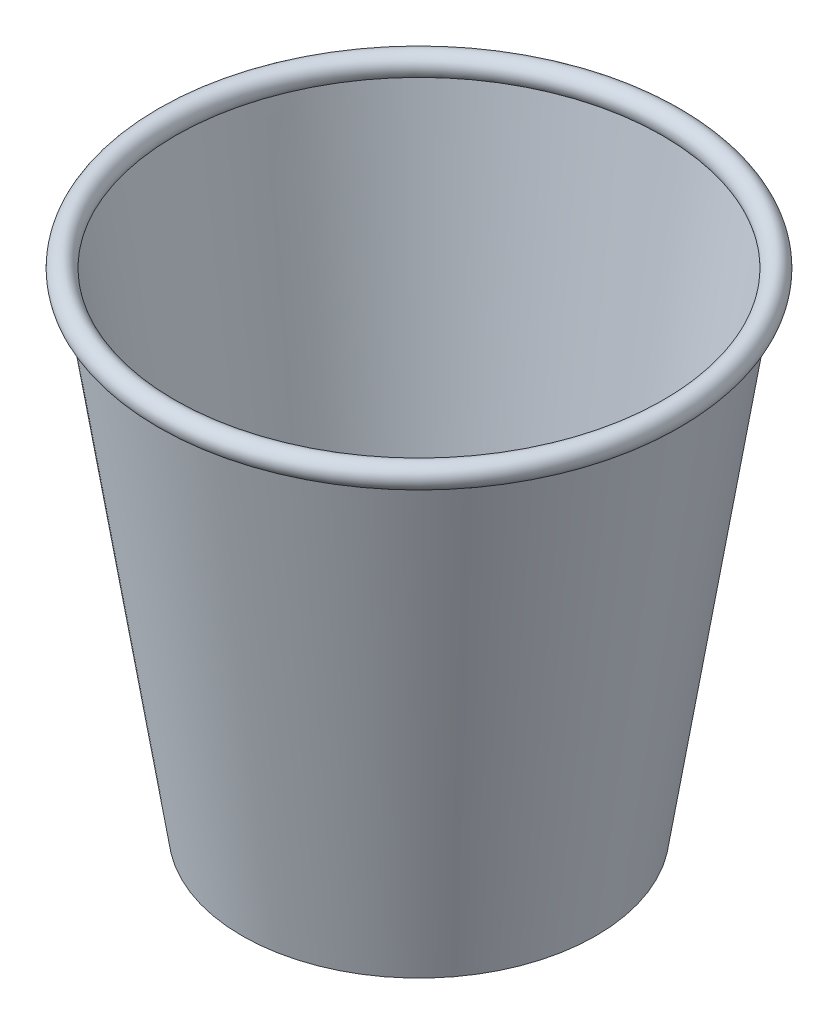
ISO-10303-21;
HEADER;
FILE_DESCRIPTION(('STEP AP214'),'2;1');
FILE_NAME('part.step','',(''),(''),'','','');
FILE_SCHEMA(('AUTOMOTIVE_DESIGN { 1 0 10303 214 1 1 1 1 }'));
ENDSEC;
DATA;
#1=APPLICATION_CONTEXT('core data for automotive mechanical design processes');
#2=APPLICATION_PROTOCOL_DEFINITION('international standard','automotive_design',2000,#1);
#3=PRODUCT_CONTEXT('',#1,'mechanical');
#4=PRODUCT('Part','Part','',(#3));
#5=PRODUCT_RELATED_PRODUCT_CATEGORY('part','',(#4));
#6=PRODUCT_DEFINITION_FORMATION('','',#4);
#7=PRODUCT_DEFINITION_CONTEXT('part definition',#1,'design');
#8=PRODUCT_DEFINITION('design','',#6,#7);
#9=PRODUCT_DEFINITION_SHAPE('','',#8);
#10=(LENGTH_UNIT() NAMED_UNIT(*) SI_UNIT(.MILLI.,.METRE.));
#11=(NAMED_UNIT(*) PLANE_ANGLE_UNIT() SI_UNIT($,.RADIAN.));
#12=(NAMED_UNIT(*) SI_UNIT($,.STERADIAN.) SOLID_ANGLE_UNIT());
#13=UNCERTAINTY_MEASURE_WITH_UNIT(LENGTH_MEASURE(1.E-05),#10,'distance_accuracy_value','');
#14=(GEOMETRIC_REPRESENTATION_CONTEXT(3) GLOBAL_UNCERTAINTY_ASSIGNED_CONTEXT((#13)) GLOBAL_UNIT_ASSIGNED_CONTEXT((#10,
#11,#12)) REPRESENTATION_CONTEXT('',''));
#15=CARTESIAN_POINT('',(0.,0.,0.));
#16=DIRECTION('',(0.,0.,1.));
#17=DIRECTION('',(1.,0.,0.));
#18=AXIS2_PLACEMENT_3D('',#15,#16,#17);
#19=CARTESIAN_POINT('',(0.,8.,0.));
#20=DIRECTION('',(0.,1.,0.));
#21=DIRECTION('',(1.,0.,0.));
#22=AXIS2_PLACEMENT_3D('',#19,#20,#21);
#23=PLANE('',#22);
#24=CARTESIAN_POINT('',(-23.7384533582512,8.,0.));
#25=CARTESIAN_POINT('',(-23.7384860565636,8.,0.388854231759771));
#26=CARTESIAN_POINT('',(-23.7289895036186,8.,0.777713839767065));
#27=CARTESIAN_POINT('',(-23.6909461064258,8.,1.55358101788836));
#28=CARTESIAN_POINT('',(-23.662444188547,8.,1.94059079293741));
#29=CARTESIAN_POINT('',(-23.586396408709,8.,2.71275926143711));
#30=CARTESIAN_POINT('',(-23.5388494165292,8.,3.09791784365658));
#31=CARTESIAN_POINT('',(-23.4247723729495,8.,3.86638581803565));
#32=CARTESIAN_POINT('',(-23.3581955504538,8.,4.24968825822375));
#33=CARTESIAN_POINT('',(-23.2064758296857,8.,5.01249563588652));
#34=CARTESIAN_POINT('',(-23.1213378580574,8.,5.39200155316045));
#35=CARTESIAN_POINT('',(-22.9326980550597,8.,6.14549828762773));
#36=CARTESIAN_POINT('',(-22.8292388608148,8.,6.51949977188672));
#37=CARTESIAN_POINT('',(-22.6040045101845,8.,7.26199451849772));
#38=CARTESIAN_POINT('',(-22.4822271812201,8.,7.63048712177504));
#39=CARTESIAN_POINT('',(-22.2204054154282,8.,8.36197692239886));
#40=CARTESIAN_POINT('',(-22.0803153861338,8.,8.72495779253293));
#41=CARTESIAN_POINT('',(-21.7826797297958,8.,9.44354051290268));
#42=CARTESIAN_POINT('',(-21.6251403046325,8.,9.7991449318701));
#43=CARTESIAN_POINT('',(-21.2931256624265,8.,10.5013617809061));
#44=CARTESIAN_POINT('',(-21.1186901838835,8.,10.8479929917362));
#45=CARTESIAN_POINT('',(-20.7529299963836,8.,11.532279829729));
#46=CARTESIAN_POINT('',(-20.5616032851955,8.,11.8699343866398));
#47=CARTESIAN_POINT('',(-20.162105800696,8.,12.5362899335344));
#48=CARTESIAN_POINT('',(-19.9538934961125,8.,12.8649660153345));
#49=CARTESIAN_POINT('',(-19.5217882830361,8.,13.5116755314246));
#50=CARTESIAN_POINT('',(-19.2979009561165,8.,13.8297126950141));
#51=CARTESIAN_POINT('',(-18.8352701731292,8.,14.4536638014694));
#52=CARTESIAN_POINT('',(-18.5965620280608,8.,14.7596039168292));
#53=CARTESIAN_POINT('',(-18.1043320798478,8.,15.3593861021489));
#54=CARTESIAN_POINT('',(-17.8508085217401,8.,15.6532267318055));
#55=CARTESIAN_POINT('',(-17.3289877513168,8.,16.2288403508773));
#56=CARTESIAN_POINT('',(-17.0606546650858,8.,16.5105808083631));
#57=CARTESIAN_POINT('',(-16.510685464726,8.,17.0605644372687));
#58=CARTESIAN_POINT('',(-16.2290540973719,8.,17.3288123552416));
#59=CARTESIAN_POINT('',(-15.6535858128869,8.,17.850519627723));
#60=CARTESIAN_POINT('',(-15.3597784222641,8.,18.1040115406627));
#61=CARTESIAN_POINT('',(-14.7599948348065,8.,18.5962397803685));
#62=CARTESIAN_POINT('',(-14.4540171977191,8.,18.83497435213));
#63=CARTESIAN_POINT('',(-13.8299264207786,8.,19.2977255347765));
#64=CARTESIAN_POINT('',(-13.5117844429819,8.,19.5217032401701));
#65=CARTESIAN_POINT('',(-12.86508626332,8.,19.9538254194673));
#66=CARTESIAN_POINT('',(-12.5365337910148,8.,20.1619754747698));
#67=CARTESIAN_POINT('',(-11.8703429284571,8.,20.5613899953725));
#68=CARTESIAN_POINT('',(-11.5327271455345,8.,20.7526921538387));
#69=CARTESIAN_POINT('',(-10.8484392657391,8.,21.118450392724));
#70=CARTESIAN_POINT('',(-10.5017660986722,8.,21.2929044708811));
#71=CARTESIAN_POINT('',(-9.79938877378697,8.,21.6250099486652));
#72=CARTESIAN_POINT('',(-9.44366392222294,8.,21.7826175643555));
#73=CARTESIAN_POINT('',(-8.72508901164129,8.,22.0802720810272));
#74=CARTESIAN_POINT('',(-8.36224152164419,8.,22.220325183763));
#75=CARTESIAN_POINT('',(-7.63092942226159,8.,22.4820976764505));
#76=CARTESIAN_POINT('',(-7.26247963224058,8.,22.603858445776));
#77=CARTESIAN_POINT('',(-6.51998425957476,8.,22.8290907998399));
#78=CARTESIAN_POINT('',(-6.14593801792127,8.,22.9325602120049));
#79=CARTESIAN_POINT('',(-5.39226611178509,8.,23.1212573576663));
#80=CARTESIAN_POINT('',(-5.01262869300362,8.,23.2064381113727));
#81=CARTESIAN_POINT('',(-4.24979148233606,8.,23.3581862692693));
#82=CARTESIAN_POINT('',(-3.8665930002052,8.,23.42476025724));
#83=CARTESIAN_POINT('',(-3.09826357785881,8.,23.5388309519181));
#84=CARTESIAN_POINT('',(-2.71313909954246,8.,23.5863711340209));
#85=CARTESIAN_POINT('',(-1.94096991478156,8.,23.6624220502085));
#86=CARTESIAN_POINT('',(-1.55392498583903,8.,23.690930524899));
#87=CARTESIAN_POINT('',(-0.777921687134413,8.,23.7289678129566));
#88=CARTESIAN_POINT('',(-0.388960954231463,8.,23.7384482560872));
#89=CARTESIAN_POINT('',(0.388823150323975,8.,23.7384584586076));
#90=CARTESIAN_POINT('',(0.777646521819663,8.,23.7289949307931));
#91=CARTESIAN_POINT('',(1.55346679831211,8.,23.6909801546402));
#92=CARTESIAN_POINT('',(1.94046584720214,8.,23.6624728069834));
#93=CARTESIAN_POINT('',(2.71263481532527,8.,23.5864196912354));
#94=CARTESIAN_POINT('',(3.09780451199514,8.,23.5388716637562));
#95=CARTESIAN_POINT('',(3.86631783168775,8.,23.4247873425584));
#96=CARTESIAN_POINT('',(4.24965433587924,8.,23.3582031469978));
#97=CARTESIAN_POINT('',(5.01249552737428,8.,23.2064750020612));
#98=CARTESIAN_POINT('',(5.39200152412554,8.,23.1213376365269));
#99=CARTESIAN_POINT('',(6.14549831662699,8.,22.93269827607));
#100=CARTESIAN_POINT('',(6.51949977967431,8.,22.8292389200369));
#101=CARTESIAN_POINT('',(7.261994510752,8.,22.6040044509404));
#102=CARTESIAN_POINT('',(7.63048711971093,8.,22.4822271653226));
#103=CARTESIAN_POINT('',(8.36197692449943,8.,22.2204054313553));
#104=CARTESIAN_POINT('',(8.72495779309832,8.,22.0803153903994));
#105=CARTESIAN_POINT('',(9.44354051234608,8.,21.7826797255282));
#106=CARTESIAN_POINT('',(9.79914493172581,8.,21.6251403034876));
#107=CARTESIAN_POINT('',(10.5013617810645,8.,21.2931256635607));
#108=CARTESIAN_POINT('',(10.8479929917862,8.,21.1186901841832));
#109=CARTESIAN_POINT('',(11.532279829699,8.,20.7529299960727));
#110=CARTESIAN_POINT('',(11.8699343866382,8.,20.5616032851087));
#111=CARTESIAN_POINT('',(12.5362899335506,8.,20.162105800775));
#112=CARTESIAN_POINT('',(12.86496601534,8.,19.9538934961328));
#113=CARTESIAN_POINT('',(13.5116755314283,8.,19.5217882830096));
#114=CARTESIAN_POINT('',(13.8297126950264,8.,19.2979009561014));
#115=CARTESIAN_POINT('',(14.4536638014918,8.,18.8352701731196));
#116=CARTESIAN_POINT('',(14.7596039168532,8.,18.5965620280455));
#117=CARTESIAN_POINT('',(15.3593861021726,8.,18.1043320798294));
#118=CARTESIAN_POINT('',(15.6532267318273,8.,17.8508085217245));
#119=CARTESIAN_POINT('',(16.2288403508905,8.,17.3289877513081));
#120=CARTESIAN_POINT('',(16.5105808083696,8.,17.0606546650812));
#121=CARTESIAN_POINT('',(17.0605644372725,8.,16.5106854647203));
#122=CARTESIAN_POINT('',(17.3288123552489,8.,16.2290540973606));
#123=CARTESIAN_POINT('',(17.8505196277351,8.,15.6535858128681));
#124=CARTESIAN_POINT('',(18.1040115406761,8.,15.3597784222435));
#125=CARTESIAN_POINT('',(18.596239780382,8.,14.759994834786));
#126=CARTESIAN_POINT('',(18.8349743521423,8.,14.4540171977005));
#127=CARTESIAN_POINT('',(19.2977255347838,8.,13.8299264207674));
#128=CARTESIAN_POINT('',(19.5217032401738,8.,13.5117844429764));
#129=CARTESIAN_POINT('',(19.9538254194649,8.,12.8650862633237));
#130=CARTESIAN_POINT('',(20.1619754747649,8.,12.536533791022));
#131=CARTESIAN_POINT('',(20.5613899953643,8.,11.8703429284692));
#132=CARTESIAN_POINT('',(20.7526921538297,8.,11.5327271455477));
#133=CARTESIAN_POINT('',(21.1184503927149,8.,10.8484392657523));
#134=CARTESIAN_POINT('',(21.2929044708727,8.,10.5017660986842));
#135=CARTESIAN_POINT('',(21.6250099486602,8.,9.79938877379419));
#136=CARTESIAN_POINT('',(21.7826175643531,8.,9.4436639222266));
#137=CARTESIAN_POINT('',(22.0802720810264,8.,8.72508901164536));
#138=CARTESIAN_POINT('',(22.2203251837616,8.,8.36224152165238));
#139=CARTESIAN_POINT('',(22.4820976764482,8.,7.63092942227525));
#140=CARTESIAN_POINT('',(22.6038584457733,8.,7.26247963225555));
#141=CARTESIAN_POINT('',(22.8290907998372,8.,6.51998425958969));
#142=CARTESIAN_POINT('',(22.9325602120024,8.,6.14593801793484));
#143=CARTESIAN_POINT('',(23.1212573576649,8.,5.39226611179325));
#144=CARTESIAN_POINT('',(23.206438111372,8.,5.0126286930077));
#145=CARTESIAN_POINT('',(23.3581862692692,8.,4.24979148233581));
#146=CARTESIAN_POINT('',(23.42476025724,8.,3.86659300020473));
#147=CARTESIAN_POINT('',(23.5388309519182,8.,3.09826357785805));
#148=CARTESIAN_POINT('',(23.5863711340209,8.,2.71313909954162));
#149=CARTESIAN_POINT('',(23.6624220502084,8.,1.94096991478071));
#150=CARTESIAN_POINT('',(23.690930524899,8.,1.55392498583826));
#151=CARTESIAN_POINT('',(23.7289678129567,8.,0.777921687133949));
#152=CARTESIAN_POINT('',(23.7384482560873,8.,0.388960954231229));
#153=CARTESIAN_POINT('',(23.7384584586075,8.,-0.388823150319575));
#154=CARTESIAN_POINT('',(23.728994930793,8.,-0.777646521810857));
#155=CARTESIAN_POINT('',(23.6909801546401,8.,-1.55346679829743));
#156=CARTESIAN_POINT('',(23.6624728069833,8.,-1.94046584718599));
#157=CARTESIAN_POINT('',(23.5864196912352,8.,-2.7126348153091));
#158=CARTESIAN_POINT('',(23.5388716637559,8.,-3.09780451198041));
#159=CARTESIAN_POINT('',(23.4247873425583,8.,-3.86631783167891));
#160=CARTESIAN_POINT('',(23.3582031469979,8.,-4.24965433587482));
#161=CARTESIAN_POINT('',(23.2064750020628,8.,-5.01249552737018));
#162=CARTESIAN_POINT('',(23.1213376365304,8.,-5.39200152411742));
#163=CARTESIAN_POINT('',(22.9326982760759,8.,-6.1454983166135));
#164=CARTESIAN_POINT('',(22.8292389200432,8.,-6.51949977965944));
#165=CARTESIAN_POINT('',(22.6040044509466,8.,-7.26199451073713));
#166=CARTESIAN_POINT('',(22.4822271653282,8.,-7.63048711969739));
#167=CARTESIAN_POINT('',(22.2204054313587,8.,-8.36197692449134));
#168=CARTESIAN_POINT('',(22.0803153904012,8.,-8.72495779309431));
#169=CARTESIAN_POINT('',(21.7826797255291,8.,-9.44354051234361));
#170=CARTESIAN_POINT('',(21.6251403034895,8.,-9.79914493172095));
#171=CARTESIAN_POINT('',(21.293125663564,8.,-10.5013617810565));
#172=CARTESIAN_POINT('',(21.1186901841869,8.,-10.8479929917773));
#173=CARTESIAN_POINT('',(20.7529299960763,8.,-11.53227982969));
#174=CARTESIAN_POINT('',(20.5616032851119,8.,-11.86993438663));
#175=CARTESIAN_POINT('',(20.162105800777,8.,-12.5362899335457));
#176=CARTESIAN_POINT('',(19.9538934961339,8.,-12.8649660153376));
#177=CARTESIAN_POINT('',(19.5217882830114,8.,-13.5116755314264));
#178=CARTESIAN_POINT('',(19.2979009561052,8.,-13.8297126950227));
#179=CARTESIAN_POINT('',(18.8352701731259,8.,-14.4536638014857));
#180=CARTESIAN_POINT('',(18.5965620280524,8.,-14.7596039168465));
#181=CARTESIAN_POINT('',(18.1043320798362,8.,-15.3593861021659));
#182=CARTESIAN_POINT('',(17.8508085217307,8.,-15.6532267318212));
#183=CARTESIAN_POINT('',(17.3289877513118,8.,-16.2288403508869));
#184=CARTESIAN_POINT('',(17.0606546650832,8.,-16.5105808083678));
#185=CARTESIAN_POINT('',(16.5106854647239,8.,-17.0605644372687));
#186=CARTESIAN_POINT('',(16.2290540973679,8.,-17.3288123552414));
#187=CARTESIAN_POINT('',(15.6535858128804,8.,-17.8505196277227));
#188=CARTESIAN_POINT('',(15.359778422257,8.,-18.1040115406624));
#189=CARTESIAN_POINT('',(14.7599948347995,8.,-18.5962397803682));
#190=CARTESIAN_POINT('',(14.4540171977127,8.,-18.8349743521297));
#191=CARTESIAN_POINT('',(13.8299264207747,8.,-19.2977255347762));
#192=CARTESIAN_POINT('',(13.5117844429801,8.,-19.52170324017));
#193=CARTESIAN_POINT('',(12.8650862633249,8.,-19.9538254194654));
#194=CARTESIAN_POINT('',(12.5365337910246,8.,-20.161975474766));
#195=CARTESIAN_POINT('',(11.8703429284734,8.,-20.561389995366));
#196=CARTESIAN_POINT('',(11.5327271455523,8.,-20.7526921538314));
#197=CARTESIAN_POINT('',(10.8484392657569,8.,-21.1184503927169));
#198=CARTESIAN_POINT('',(10.5017660986884,8.,-21.2929044708749));
#199=CARTESIAN_POINT('',(9.79938877379671,8.,-21.6250099486609));
#200=CARTESIAN_POINT('',(9.44366392222786,8.,-21.782617564352));
#201=CARTESIAN_POINT('',(8.72508901164527,8.,-22.080272081027));
#202=CARTESIAN_POINT('',(8.36224152165222,8.,-22.2203251837656));
#203=CARTESIAN_POINT('',(7.63092942227519,8.,-22.4820976764388));
#204=CARTESIAN_POINT('',(7.26247963225564,8.,-22.6038584457473));
#205=CARTESIAN_POINT('',(6.51998425958942,8.,-22.8290907998559));
#206=CARTESIAN_POINT('',(6.14593801793404,8.,-22.9325602120826));
#207=CARTESIAN_POINT('',(5.39226611179392,8.,-23.121257357579));
#208=CARTESIAN_POINT('',(5.01262869301039,8.,-23.2064381110577));
#209=CARTESIAN_POINT('',(4.24979148233777,8.,-23.3581862695825));
#210=CARTESIAN_POINT('',(3.86659300020399,8.,-23.4247602584088));
#211=CARTESIAN_POINT('',(3.09826357788356,8.,-23.5388309507524));
#212=CARTESIAN_POINT('',(2.71313909959599,8.,-23.5863711296741));
#213=CARTESIAN_POINT('',(1.94096991476034,8.,-23.662422054556));
#214=CARTESIAN_POINT('',(1.55392498571426,8.,-23.6909305411236));
#215=CARTESIAN_POINT('',(0.777921687283017,8.,-23.728967796691));
#216=CARTESIAN_POINT('',(0.38896095475821,8.,-23.7384481953114));
#217=CARTESIAN_POINT('',(-0.388826306250338,8.,-23.7384585194037));
#218=CARTESIAN_POINT('',(-0.777652834580244,8.,-23.728995003917));
#219=CARTESIAN_POINT('',(-1.55347731809478,8.,-23.6909801848428));
#220=CARTESIAN_POINT('',(-1.94047742221135,8.,-23.6624728853632));
#221=CARTESIAN_POINT('',(-2.71264640514893,8.,-23.5864198186413));
#222=CARTESIAN_POINT('',(-3.09781507152525,8.,-23.5388718947166));
#223=CARTESIAN_POINT('',(-3.86632416493655,8.,-23.4247874143773));
#224=CARTESIAN_POINT('',(-4.24965748775832,8.,-23.3582030548758));
#225=CARTESIAN_POINT('',(-5.01250156908767,8.,-23.2064732657659));
#226=CARTESIAN_POINT('',(-5.39201354797717,8.,-23.1213339721097));
#227=CARTESIAN_POINT('',(-6.1455183063635,8.,-22.9326920172971));
#228=CARTESIAN_POINT('',(-6.51952180262656,8.,-22.8292321926306));
#229=CARTESIAN_POINT('',(-7.26201656124643,8.,-22.603997811142));
#230=CARTESIAN_POINT('',(-7.63050722445028,8.,-22.4822212792711));
#231=CARTESIAN_POINT('',(-8.36198895204254,8.,-22.2204017854541));
#232=CARTESIAN_POINT('',(-8.72496375767913,8.,-22.0803134222501));
#233=CARTESIAN_POINT('',(-9.44354612190459,8.,-21.7826768998516));
#234=CARTESIAN_POINT('',(-9.7991560157152,8.,-21.6251343787194));
#235=CARTESIAN_POINT('',(-10.5013801596183,8.,-21.2931156103136));
#236=CARTESIAN_POINT('',(-10.8480132774934,8.,-21.1186792855815));
#237=CARTESIAN_POINT('',(-11.5323001627557,8.,-20.7529191860284));
#238=CARTESIAN_POINT('',(-11.8699529571889,8.,-20.5615935909962));
#239=CARTESIAN_POINT('',(-12.5363010182683,8.,-20.1620998773987));
#240=CARTESIAN_POINT('',(-12.8649714812277,8.,-19.9538904018825));
#241=CARTESIAN_POINT('',(-13.511680482057,8.,-19.5217844175434));
#242=CARTESIAN_POINT('',(-13.8297224102096,8.,-19.2978929828704));
#243=CARTESIAN_POINT('',(-14.4536798655898,8.,-18.8352567274816));
#244=CARTESIAN_POINT('',(-14.7596216865622,8.,-18.5965473812847));
#245=CARTESIAN_POINT('',(-15.3594039356146,8.,-18.1043175107283));
#246=CARTESIAN_POINT('',(-15.6532430543303,8.,-17.8507953909464));
#247=CARTESIAN_POINT('',(-16.228850067026,8.,-17.3289797792174));
#248=CARTESIAN_POINT('',(-16.5105855655745,8.,-17.0606505639409));
#249=CARTESIAN_POINT('',(-17.0605685386606,8.,-16.5106807077113));
#250=CARTESIAN_POINT('',(-17.3288203282551,8.,-16.2290443819983));
#251=CARTESIAN_POINT('',(-17.8505327600473,8.,-15.6535694916389));
#252=CARTESIAN_POINT('',(-18.104026111498,8.,-15.3597605902231));
#253=CARTESIAN_POINT('',(-18.5962544288647,8.,-14.7599770665001));
#254=CARTESIAN_POINT('',(-18.8349877993238,8.,-14.4540011348703));
#255=CARTESIAN_POINT('',(-19.297733508943,8.,-13.8299167063363));
#256=CARTESIAN_POINT('',(-19.5217071058647,8.,-13.5117794925517));
#257=CARTESIAN_POINT('',(-19.9538285140145,8.,-12.8650807975768));
#258=CARTESIAN_POINT('',(-20.1619813992484,8.,-12.5365227068846));
#259=CARTESIAN_POINT('',(-20.5613996911988,8.,-11.8703243588318));
#260=CARTESIAN_POINT('',(-20.7527029656787,8.,-11.5327068134726));
#261=CARTESIAN_POINT('',(-21.1184612934813,8.,-10.8484189811319));
#262=CARTESIAN_POINT('',(-21.2929145265673,8.,-10.5017477212443));
#263=CARTESIAN_POINT('',(-21.6250158738252,8.,-9.7993776901531));
#264=CARTESIAN_POINT('',(-21.7826203877894,8.,-9.44365831209016));
#265=CARTESIAN_POINT('',(-22.080274051996,8.,-8.72508304787975));
#266=CARTESIAN_POINT('',(-22.2203288401995,8.,-8.3622294971928));
#267=CARTESIAN_POINT('',(-22.4821035550192,8.,-7.63090931541572));
#268=CARTESIAN_POINT('',(-22.6038650527376,8.,-7.26245757230796));
#269=CARTESIAN_POINT('',(-22.8290975643333,8.,-6.51996224740691));
#270=CARTESIAN_POINT('',(-22.932566603156,8.,-6.14591806651564));
#271=CARTESIAN_POINT('',(-23.1212608924192,8.,-5.39225405045322));
#272=CARTESIAN_POINT('',(-23.2064393592197,8.,-5.01262251005235));
#273=CARTESIAN_POINT('',(-23.3581936211759,8.,-4.24975443439173));
#274=CARTESIAN_POINT('',(-23.4247738940499,8.,-3.86651878986707));
#275=CARTESIAN_POINT('',(-23.5388542445761,8.,-3.09813954405496));
#276=CARTESIAN_POINT('',(-23.5863990179071,8.,-2.71300258739283));
#277=CARTESIAN_POINT('',(-23.6624458872592,8.,-1.94083382383273));
#278=CARTESIAN_POINT('',(-23.6909469558772,8.,-1.55380191583712));
#279=CARTESIAN_POINT('',(-23.7289908150171,8.,-0.777846349113018));
#280=CARTESIAN_POINT('',(-23.7384865102987,8.,-0.388920379112437));
#281=CARTESIAN_POINT('',(-23.7384533582512,8.,0.));
#282=B_SPLINE_CURVE_WITH_KNOTS('',3,(#24,#25,#26,#27,#28,#29,#30,#31,#32,#33,#34,#35,#36,#37,
#38,#39,#40,#41,#42,#43,#44,#45,#46,#47,#48,#49,#50,#51,#52,#53,#54,#55,#56,#57,#58,#59,#60,#61,
#62,#63,#64,#65,#66,#67,#68,#69,#70,#71,#72,#73,#74,#75,#76,#77,#78,#79,#80,#81,#82,#83,#84,#85,
#86,#87,#88,#89,#90,#91,#92,#93,#94,#95,#96,#97,#98,#99,#100,#101,#102,#103,#104,#105,#106,#107,
#108,#109,#110,#111,#112,#113,#114,#115,#116,#117,#118,#119,#120,#121,#122,#123,#124,#125,#126,
#127,#128,#129,#130,#131,#132,#133,#134,#135,#136,#137,#138,#139,#140,#141,#142,#143,#144,#145,
#146,#147,#148,#149,#150,#151,#152,#153,#154,#155,#156,#157,#158,#159,#160,#161,#162,#163,#164,
#165,#166,#167,#168,#169,#170,#171,#172,#173,#174,#175,#176,#177,#178,#179,#180,#181,#182,#183,
#184,#185,#186,#187,#188,#189,#190,#191,#192,#193,#194,#195,#196,#197,#198,#199,#200,#201,#202,
#203,#204,#205,#206,#207,#208,#209,#210,#211,#212,#213,#214,#215,#216,#217,#218,#219,#220,#221,
#222,#223,#224,#225,#226,#227,#228,#229,#230,#231,#232,#233,#234,#235,#236,#237,#238,#239,#240,
#241,#242,#243,#244,#245,#246,#247,#248,#249,#250,#251,#252,#253,#254,#255,#256,#257,#258,#259,
#260,#261,#262,#263,#264,#265,#266,#267,#268,#269,#270,#271,#272,#273,#274,#275,#276,#277,#278,
#279,#280,#281),.UNSPECIFIED.,.F.,.F.,(4,2,2,2,2,2,2,2,2,2,2,2,2,2,2,2,2,2,2,2,2,2,2,2,2,2,2,2,
2,2,2,2,2,2,2,2,2,2,2,2,2,2,2,2,2,2,2,2,2,2,2,2,2,2,2,2,2,2,2,2,2,2,2,2,2,2,2,2,2,2,2,2,2,2,2,2,
2,2,2,2,2,2,2,2,2,2,2,2,2,2,2,2,2,2,2,2,2,2,2,2,2,2,2,2,2,2,2,2,2,2,2,2,2,2,2,2,2,2,2,2,2,2,2,2,
2,2,2,2,4),(0.,1.16645328158324,2.33015893863912,3.49393366546868,4.66059365610278,
5.82694435899601,6.99061557292412,8.15442491029837,9.32118898286971,10.4875396857683,
11.6512108996982,12.8150202370707,13.9817843096367,15.1481350125218,16.3118062264473,
17.4756155638242,18.6423796364033,19.8087303392926,20.9724015532194,22.136210890595,
23.3029749631706,24.4693256660824,25.6329968800166,26.7968062173847,27.9635702899375,
29.1299209928602,30.2935922067981,31.4574015441626,32.6241656167046,33.7905163196218,
34.954187533558,36.1179968709242,37.2847609434713,38.4511116463817,39.6147828603156,
40.7785921976841,41.9453562702383,43.11170697315,44.2753781870843,45.4391875244523,
46.6059515970051,47.772302299913,48.935973513846,50.0997828512153,51.2665469237721,
52.4328976266811,53.5965688406145,54.7603781779835,55.927142250539,57.093492953448,
58.2571641673814,59.4209735047504,60.5877375773059,61.7540882802046,62.9177594941345,
64.0815688315069,65.2483329040726,66.4146836069831,67.5783548209169,68.7421641582855,
69.9089282308399,71.0752789337579,72.2389501476943,73.4027594850602,74.5695235576066,
75.7358742605039,76.8995454744333,78.0633548118062,79.2301188843734,80.3964695872721,
81.560140801202,82.7239501385745,83.8907142111404,85.0570649140405,86.2207361279708,
87.3845454653428,88.5513095379072,89.7176602408086,90.8813314547394,92.0451407921109,
93.2119048646743,94.3782555675676,95.5419267814958,96.70573611887,97.872500191441,
99.0388508943372,100.202522108266,101.36633144564,102.533095518208,103.699446221118,
104.863117435051,106.02692677242,107.193690844975,108.360041547879,109.523712761811,
110.687522099182,111.854286171742,113.020646339901,114.184320701322,115.348126906436,
116.514881650489,117.681251142978,118.844928635258,120.008731694293,121.175476977357,
122.341846469835,123.505523962111,124.669327021151,125.836072304226,127.002441796712,
128.166119288991,129.329922348027,130.496667631094,131.663037123574,132.826714615851,
133.99051767489,135.157262957962,136.32363245045,137.48730994273,138.651113001766,
139.817858284831,140.984227777308,142.147905269584,143.311708328623,144.478453611699,
145.64491774552,146.808626708967,147.97239844915,149.139050458287),.UNSPECIFIED.);
#283=CARTESIAN_POINT('',(-23.7384533582512,8.,0.));
#284=VERTEX_POINT('',#283);
#285=EDGE_CURVE('P0_E9',#284,#284,#282,.T.);
#286=ORIENTED_EDGE('',*,*,#285,.T.);
#287=EDGE_LOOP('',(#286));
#288=FACE_BOUND('',#287,.T.);
#289=ADVANCED_FACE('P0_F13',(#288),#23,.T.);
#290=OPEN_SHELL('',(#289));
#291=SHELL_BASED_SURFACE_MODEL('P0_B1',(#290));
#292=CARTESIAN_POINT('',(0.,0.,0.));
#293=DIRECTION('',(0.,-1.,0.));
#294=DIRECTION('',(1.,0.,0.));
#295=AXIS2_PLACEMENT_3D('',#292,#293,#294);
#296=CONICAL_SURFACE('',#295,22.5,1.41814699839963);
#297=CARTESIAN_POINT('',(0.,-0.152057184253941,0.));
#298=DIRECTION('',(0.,1.,0.));
#299=DIRECTION('',(1.,0.,0.));
#300=AXIS2_PLACEMENT_3D('',#297,#298,#299);
#301=CIRCLE('',#300,23.4883716976506);
#302=CARTESIAN_POINT('',(-23.4883716976506,-0.152057184253941,0.));
#303=VERTEX_POINT('',#302);
#304=EDGE_CURVE('P1_E89',#303,#303,#301,.T.);
#305=ORIENTED_EDGE('',*,*,#304,.F.);
#306=DIRECTION('',(0.988371697650617,0.152057184253941,0.));
#307=VECTOR('',#306,1.);
#308=CARTESIAN_POINT('',(-22.5,0.,0.));
#309=LINE('',#308,#307);
#310=CARTESIAN_POINT('',(-22.5,0.,0.));
#311=VERTEX_POINT('',#310);
#312=EDGE_CURVE('P1_E10',#303,#311,#309,.T.);
#313=ORIENTED_EDGE('',*,*,#312,.T.);
#314=CARTESIAN_POINT('',(0.,0.,0.));
#315=DIRECTION('',(0.,1.,0.));
#316=DIRECTION('',(1.,0.,0.));
#317=AXIS2_PLACEMENT_3D('',#314,#315,#316);
#318=CIRCLE('',#317,22.5);
#319=CARTESIAN_POINT('',(22.5,0.,0.));
#320=VERTEX_POINT('',#319);
#321=EDGE_CURVE('P1_E18',#311,#320,#318,.T.);
#322=ORIENTED_EDGE('',*,*,#321,.T.);
#323=CARTESIAN_POINT('',(0.,0.,0.));
#324=DIRECTION('',(0.,1.,0.));
#325=DIRECTION('',(1.,0.,0.));
#326=AXIS2_PLACEMENT_3D('',#323,#324,#325);
#327=CIRCLE('',#326,22.5);
#328=EDGE_CURVE('P1_E86',#320,#311,#327,.T.);
#329=ORIENTED_EDGE('',*,*,#328,.T.);
#330=ORIENTED_EDGE('',*,*,#312,.F.);
#331=EDGE_LOOP('',(#305,#313,#322,#329,#330));
#332=FACE_BOUND('',#331,.T.);
#333=ADVANCED_FACE('P1_F15',(#332),#296,.F.);
#334=CARTESIAN_POINT('',(0.,65.,0.));
#335=DIRECTION('',(0.,1.,0.));
#336=DIRECTION('',(1.,0.,0.));
#337=AXIS2_PLACEMENT_3D('',#334,#335,#336);
#338=CONICAL_SURFACE('',#337,32.5,0.152649328395265);
#339=CARTESIAN_POINT('',(0.,63.8949668485082,0.));
#340=DIRECTION('',(0.,1.,0.));
#341=DIRECTION('',(1.,0.,0.));
#342=AXIS2_PLACEMENT_3D('',#339,#340,#341);
#343=CIRCLE('',#342,32.3299948997705);
#344=CARTESIAN_POINT('',(-32.3299948997705,63.8949668485082,0.));
#345=VERTEX_POINT('',#344);
#346=CARTESIAN_POINT('',(0.,63.8949668485082,32.3299948997705));
#347=VERTEX_POINT('',#346);
#348=EDGE_CURVE('P1_E69',#345,#347,#343,.T.);
#349=ORIENTED_EDGE('',*,*,#348,.T.);
#350=CARTESIAN_POINT('',(0.,63.8949668485082,0.));
#351=DIRECTION('',(0.,1.,0.));
#352=DIRECTION('',(1.,0.,0.));
#353=AXIS2_PLACEMENT_3D('',#350,#351,#352);
#354=CIRCLE('',#353,32.3299948997705);
#355=EDGE_CURVE('P1_E66',#347,#345,#354,.T.);
#356=ORIENTED_EDGE('',*,*,#355,.T.);
#357=DIRECTION('',(0.152057184253941,-0.988371697650617,0.));
#358=VECTOR('',#357,1.);
#359=CARTESIAN_POINT('',(-32.5,65.,0.));
#360=LINE('',#359,#358);
#361=EDGE_CURVE('P1_E102',#345,#311,#360,.T.);
#362=ORIENTED_EDGE('',*,*,#361,.T.);
#363=ORIENTED_EDGE('',*,*,#328,.F.);
#364=ORIENTED_EDGE('',*,*,#321,.F.);
#365=ORIENTED_EDGE('',*,*,#361,.F.);
#366=EDGE_LOOP('',(#349,#356,#362,#363,#364,#365));
#367=FACE_BOUND('',#366,.T.);
#368=ADVANCED_FACE('P1_F139',(#367),#338,.F.);
#369=CARTESIAN_POINT('',(0.,64.8479428157461,0.));
#370=DIRECTION('',(0.,1.,0.));
#371=DIRECTION('',(1.,0.,0.));
#372=AXIS2_PLACEMENT_3D('',#369,#370,#371);
#373=CONICAL_SURFACE('',#372,33.4883716976506,0.152649328395265);
#374=ORIENTED_EDGE('',*,*,#304,.T.);
#375=DIRECTION('',(-0.152057184253941,0.988371697650617,0.));
#376=VECTOR('',#375,1.);
#377=CARTESIAN_POINT('',(-33.4883716976506,64.8479428157461,0.));
#378=LINE('',#377,#376);
#379=CARTESIAN_POINT('',(-33.2602859212697,63.3653852692701,0.));
#380=VERTEX_POINT('',#379);
#381=EDGE_CURVE('P1_E79',#303,#380,#378,.T.);
#382=ORIENTED_EDGE('',*,*,#381,.T.);
#383=CARTESIAN_POINT('',(0.,63.3653852692701,0.));
#384=DIRECTION('',(0.,-1.,0.));
#385=DIRECTION('',(1.,0.,0.));
#386=AXIS2_PLACEMENT_3D('',#383,#384,#385);
#387=CIRCLE('',#386,33.2602859212697);
#388=CARTESIAN_POINT('',(0.,63.3653852692701,33.2602859212697));
#389=VERTEX_POINT('',#388);
#390=EDGE_CURVE('P1_E63',#380,#389,#387,.T.);
#391=ORIENTED_EDGE('',*,*,#390,.T.);
#392=CARTESIAN_POINT('',(0.,63.3653852692701,0.));
#393=DIRECTION('',(0.,-1.,0.));
#394=DIRECTION('',(1.,0.,0.));
#395=AXIS2_PLACEMENT_3D('',#392,#393,#394);
#396=CIRCLE('',#395,33.2602859212697);
#397=EDGE_CURVE('P1_E70',#389,#380,#396,.T.);
#398=ORIENTED_EDGE('',*,*,#397,.T.);
#399=ORIENTED_EDGE('',*,*,#381,.F.);
#400=EDGE_LOOP('',(#374,#382,#391,#398,#399));
#401=FACE_BOUND('',#400,.T.);
#402=ADVANCED_FACE('P1_F78',(#401),#373,.T.);
#403=CARTESIAN_POINT('',(0.,64.8479428157461,0.));
#404=DIRECTION('',(0.,-1.,0.));
#405=DIRECTION('',(0.,0.,-1.));
#406=AXIS2_PLACEMENT_3D('',#403,#404,#405);
#407=TOROIDAL_SURFACE('',#406,33.4883716976506,1.5);
#408=ORIENTED_EDGE('',*,*,#390,.F.);
#409=ORIENTED_EDGE('',*,*,#397,.F.);
#410=CARTESIAN_POINT('',(0.,64.8479428157461,33.4883716976506));
#411=DIRECTION('',(-1.,0.,0.));
#412=DIRECTION('',(0.,0.,1.));
#413=AXIS2_PLACEMENT_3D('',#410,#411,#412);
#414=CIRCLE('',#413,1.5);
#415=EDGE_CURVE('P1_E59',#389,#347,#414,.T.);
#416=ORIENTED_EDGE('',*,*,#415,.T.);
#417=ORIENTED_EDGE('',*,*,#348,.F.);
#418=ORIENTED_EDGE('',*,*,#355,.F.);
#419=ORIENTED_EDGE('',*,*,#415,.F.);
#420=EDGE_LOOP('',(#408,#409,#416,#417,#418,#419));
#421=FACE_BOUND('',#420,.T.);
#422=ADVANCED_FACE('P1_F61',(#421),#407,.T.);
#423=CLOSED_SHELL('',(#333,#368,#402,#422));
#424=MANIFOLD_SOLID_BREP('P1_B1',#423);
#425=ADVANCED_BREP_SHAPE_REPRESENTATION('',(#18,#424),#14);
#426=MANIFOLD_SURFACE_SHAPE_REPRESENTATION('',(#18,#291),#14);
#427=SHAPE_REPRESENTATION('',(#18),#14);
#428=SHAPE_DEFINITION_REPRESENTATION(#9,#427);
#429=SHAPE_REPRESENTATION_RELATIONSHIP('','',#427,#425);
#430=SHAPE_REPRESENTATION_RELATIONSHIP('','',#427,#426);
ENDSEC;
END-ISO-10303-21;
